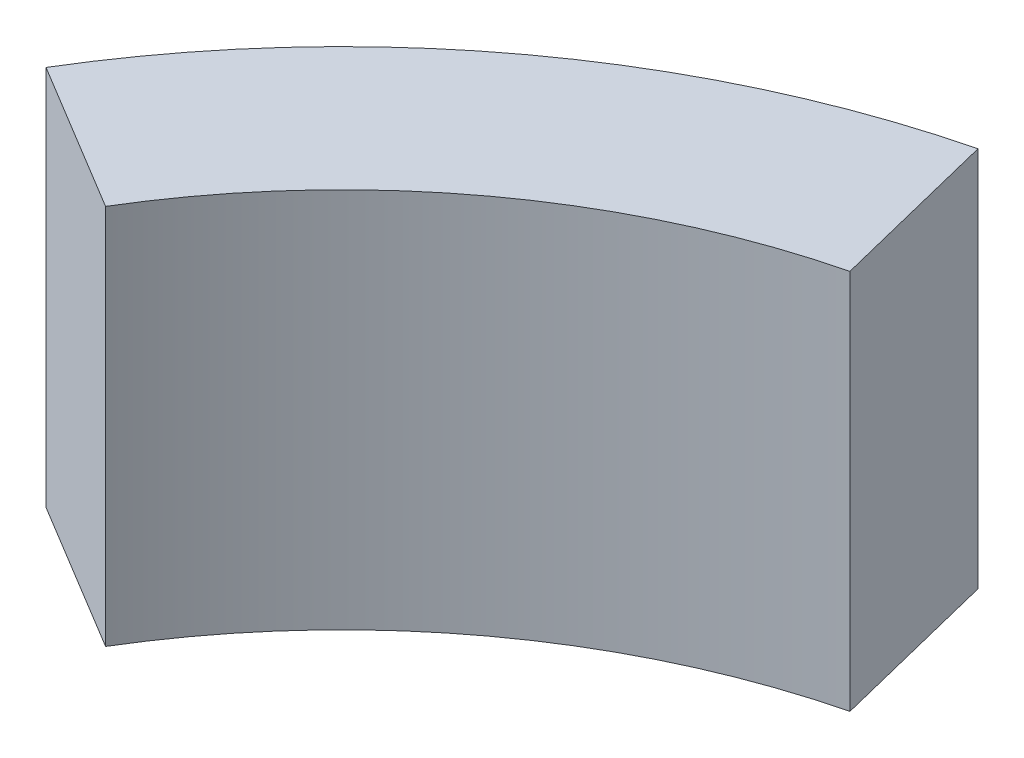
ISO-10303-21;
HEADER;
FILE_DESCRIPTION(('STEP AP214'),'2;1');
FILE_NAME('part.step','',(''),(''),'','','');
FILE_SCHEMA(('AUTOMOTIVE_DESIGN { 1 0 10303 214 1 1 1 1 }'));
ENDSEC;
DATA;
#1=APPLICATION_CONTEXT('core data for automotive mechanical design processes');
#2=APPLICATION_PROTOCOL_DEFINITION('international standard','automotive_design',2000,#1);
#3=PRODUCT_CONTEXT('',#1,'mechanical');
#4=PRODUCT('Part','Part','',(#3));
#5=PRODUCT_RELATED_PRODUCT_CATEGORY('part','',(#4));
#6=PRODUCT_DEFINITION_FORMATION('','',#4);
#7=PRODUCT_DEFINITION_CONTEXT('part definition',#1,'design');
#8=PRODUCT_DEFINITION('design','',#6,#7);
#9=PRODUCT_DEFINITION_SHAPE('','',#8);
#10=(LENGTH_UNIT() NAMED_UNIT(*) SI_UNIT(.MILLI.,.METRE.));
#11=(NAMED_UNIT(*) PLANE_ANGLE_UNIT() SI_UNIT($,.RADIAN.));
#12=(NAMED_UNIT(*) SI_UNIT($,.STERADIAN.) SOLID_ANGLE_UNIT());
#13=UNCERTAINTY_MEASURE_WITH_UNIT(LENGTH_MEASURE(1.E-05),#10,'distance_accuracy_value','');
#14=(GEOMETRIC_REPRESENTATION_CONTEXT(3) GLOBAL_UNCERTAINTY_ASSIGNED_CONTEXT((#13)) GLOBAL_UNIT_ASSIGNED_CONTEXT((#10,
#11,#12)) REPRESENTATION_CONTEXT('',''));
#15=CARTESIAN_POINT('',(0.,0.,0.));
#16=DIRECTION('',(0.,0.,1.));
#17=DIRECTION('',(1.,0.,0.));
#18=AXIS2_PLACEMENT_3D('',#15,#16,#17);
#19=CARTESIAN_POINT('',(0.,12.,0.));
#20=DIRECTION('',(0.,-1.,0.));
#21=DIRECTION('',(0.,0.,-1.));
#22=AXIS2_PLACEMENT_3D('',#19,#20,#21);
#23=CYLINDRICAL_SURFACE('',#22,27.42);
#24=CARTESIAN_POINT('',(0.,0.,0.));
#25=DIRECTION('',(0.,1.,0.));
#26=DIRECTION('',(0.,0.,-1.));
#27=AXIS2_PLACEMENT_3D('',#24,#25,#26);
#28=CIRCLE('',#27,27.42);
#29=CARTESIAN_POINT('',(-6.58973102171448,0.,-26.6163830198893));
#30=VERTEX_POINT('',#29);
#31=CARTESIAN_POINT('',(-23.4802684156719,0.,-14.1609814323725));
#32=VERTEX_POINT('',#31);
#33=EDGE_CURVE('E96',#30,#32,#28,.T.);
#34=ORIENTED_EDGE('',*,*,#33,.T.);
#35=DIRECTION('',(0.,-1.,0.));
#36=VECTOR('',#35,1.);
#37=CARTESIAN_POINT('',(-23.4802684156719,12.,-14.1609814323725));
#38=LINE('',#37,#36);
#39=CARTESIAN_POINT('',(-23.4802684156719,12.,-14.1609814323725));
#40=VERTEX_POINT('',#39);
#41=EDGE_CURVE('E11',#40,#32,#38,.T.);
#42=ORIENTED_EDGE('',*,*,#41,.F.);
#43=CARTESIAN_POINT('',(0.,12.,0.));
#44=DIRECTION('',(0.,1.,0.));
#45=DIRECTION('',(0.,0.,-1.));
#46=AXIS2_PLACEMENT_3D('',#43,#44,#45);
#47=CIRCLE('',#46,27.42);
#48=CARTESIAN_POINT('',(-6.58973102171448,12.,-26.6163830198893));
#49=VERTEX_POINT('',#48);
#50=EDGE_CURVE('E84',#49,#40,#47,.T.);
#51=ORIENTED_EDGE('',*,*,#50,.F.);
#52=DIRECTION('',(0.,-1.,0.));
#53=VECTOR('',#52,1.);
#54=CARTESIAN_POINT('',(-6.58973102171448,12.,-26.6163830198893));
#55=LINE('',#54,#53);
#56=EDGE_CURVE('E92',#49,#30,#55,.T.);
#57=ORIENTED_EDGE('',*,*,#56,.T.);
#58=EDGE_LOOP('',(#34,#42,#51,#57));
#59=FACE_BOUND('',#58,.T.);
#60=ADVANCED_FACE('F33',(#59),#23,.T.);
#61=CARTESIAN_POINT('',(-23.4802684156719,12.,-14.1609814323725));
#62=DIRECTION('',(0.51644717112956,0.,-0.856319052358568));
#63=DIRECTION('',(-0.856319052358568,0.,-0.51644717112956));
#64=AXIS2_PLACEMENT_3D('',#61,#62,#63);
#65=PLANE('',#64);
#66=DIRECTION('',(0.856319052358568,0.,0.51644717112956));
#67=VECTOR('',#66,1.);
#68=CARTESIAN_POINT('',(-23.4802684156719,0.,-14.1609814323725));
#69=LINE('',#68,#67);
#70=CARTESIAN_POINT('',(-18.7533872466526,0.,-11.3101930477374));
#71=VERTEX_POINT('',#70);
#72=EDGE_CURVE('E88',#32,#71,#69,.T.);
#73=ORIENTED_EDGE('',*,*,#72,.T.);
#74=DIRECTION('',(0.,-1.,0.));
#75=VECTOR('',#74,1.);
#76=CARTESIAN_POINT('',(-18.7533872466526,12.,-11.3101930477374));
#77=LINE('',#76,#75);
#78=CARTESIAN_POINT('',(-18.7533872466526,12.,-11.3101930477374));
#79=VERTEX_POINT('',#78);
#80=EDGE_CURVE('E41',#79,#71,#77,.T.);
#81=ORIENTED_EDGE('',*,*,#80,.F.);
#82=DIRECTION('',(0.856319052358568,0.,0.51644717112956));
#83=VECTOR('',#82,1.);
#84=CARTESIAN_POINT('',(-23.4802684156719,12.,-14.1609814323725));
#85=LINE('',#84,#83);
#86=EDGE_CURVE('E79',#40,#79,#85,.T.);
#87=ORIENTED_EDGE('',*,*,#86,.F.);
#88=ORIENTED_EDGE('',*,*,#41,.T.);
#89=EDGE_LOOP('',(#73,#81,#87,#88));
#90=FACE_BOUND('',#89,.T.);
#91=ADVANCED_FACE('F87',(#90),#65,.F.);
#92=CARTESIAN_POINT('',(0.,12.,0.));
#93=DIRECTION('',(0.,-1.,0.));
#94=DIRECTION('',(0.,0.,-1.));
#95=AXIS2_PLACEMENT_3D('',#92,#93,#94);
#96=CYLINDRICAL_SURFACE('',#95,21.9);
#97=CARTESIAN_POINT('',(0.,0.,0.));
#98=DIRECTION('',(0.,-1.,0.));
#99=DIRECTION('',(0.,0.,-1.));
#100=AXIS2_PLACEMENT_3D('',#97,#98,#99);
#101=CIRCLE('',#100,21.9);
#102=CARTESIAN_POINT('',(-5.26313309174132,0.,-21.2581614929094));
#103=VERTEX_POINT('',#102);
#104=EDGE_CURVE('E66',#71,#103,#101,.T.);
#105=ORIENTED_EDGE('',*,*,#104,.T.);
#106=DIRECTION('',(0.,-1.,0.));
#107=VECTOR('',#106,1.);
#108=CARTESIAN_POINT('',(-5.26313309174132,12.,-21.2581614929094));
#109=LINE('',#108,#107);
#110=CARTESIAN_POINT('',(-5.26313309174132,12.,-21.2581614929094));
#111=VERTEX_POINT('',#110);
#112=EDGE_CURVE('E89',#111,#103,#109,.T.);
#113=ORIENTED_EDGE('',*,*,#112,.F.);
#114=CARTESIAN_POINT('',(0.,12.,0.));
#115=DIRECTION('',(0.,-1.,0.));
#116=DIRECTION('',(0.,0.,-1.));
#117=AXIS2_PLACEMENT_3D('',#114,#115,#116);
#118=CIRCLE('',#117,21.9);
#119=EDGE_CURVE('E82',#79,#111,#118,.T.);
#120=ORIENTED_EDGE('',*,*,#119,.F.);
#121=ORIENTED_EDGE('',*,*,#80,.T.);
#122=EDGE_LOOP('',(#105,#113,#120,#121));
#123=FACE_BOUND('',#122,.T.);
#124=ADVANCED_FACE('F90',(#123),#96,.F.);
#125=CARTESIAN_POINT('',(-6.58973102171448,12.,-26.6163830198893));
#126=DIRECTION('',(-0.970692305612303,0.,0.240325711951659));
#127=DIRECTION('',(0.240325711951659,0.,0.970692305612303));
#128=AXIS2_PLACEMENT_3D('',#125,#126,#127);
#129=PLANE('',#128);
#130=DIRECTION('',(-0.240325711951659,0.,-0.970692305612303));
#131=VECTOR('',#130,1.);
#132=CARTESIAN_POINT('',(-6.58973102171448,0.,-26.6163830198893));
#133=LINE('',#132,#131);
#134=EDGE_CURVE('E72',#103,#30,#133,.T.);
#135=ORIENTED_EDGE('',*,*,#134,.T.);
#136=ORIENTED_EDGE('',*,*,#56,.F.);
#137=DIRECTION('',(-0.240325711951659,0.,-0.970692305612303));
#138=VECTOR('',#137,1.);
#139=CARTESIAN_POINT('',(-6.58973102171448,12.,-26.6163830198893));
#140=LINE('',#139,#138);
#141=EDGE_CURVE('E49',#111,#49,#140,.T.);
#142=ORIENTED_EDGE('',*,*,#141,.F.);
#143=ORIENTED_EDGE('',*,*,#112,.T.);
#144=EDGE_LOOP('',(#135,#136,#142,#143));
#145=FACE_BOUND('',#144,.T.);
#146=ADVANCED_FACE('F103',(#145),#129,.F.);
#147=CARTESIAN_POINT('',(0.,12.,0.));
#148=DIRECTION('',(0.,-1.,0.));
#149=DIRECTION('',(0.,0.,-1.));
#150=AXIS2_PLACEMENT_3D('',#147,#148,#149);
#151=PLANE('',#150);
#152=ORIENTED_EDGE('',*,*,#50,.T.);
#153=ORIENTED_EDGE('',*,*,#86,.T.);
#154=ORIENTED_EDGE('',*,*,#119,.T.);
#155=ORIENTED_EDGE('',*,*,#141,.T.);
#156=EDGE_LOOP('',(#152,#153,#154,#155));
#157=FACE_BOUND('',#156,.T.);
#158=ADVANCED_FACE('F80',(#157),#151,.F.);
#159=CARTESIAN_POINT('',(0.,0.,0.));
#160=DIRECTION('',(0.,-1.,0.));
#161=DIRECTION('',(0.,0.,-1.));
#162=AXIS2_PLACEMENT_3D('',#159,#160,#161);
#163=PLANE('',#162);
#164=ORIENTED_EDGE('',*,*,#33,.F.);
#165=ORIENTED_EDGE('',*,*,#134,.F.);
#166=ORIENTED_EDGE('',*,*,#104,.F.);
#167=ORIENTED_EDGE('',*,*,#72,.F.);
#168=EDGE_LOOP('',(#164,#165,#166,#167));
#169=FACE_BOUND('',#168,.T.);
#170=ADVANCED_FACE('F106',(#169),#163,.T.);
#171=CLOSED_SHELL('',(#60,#91,#124,#146,#158,#170));
#172=MANIFOLD_SOLID_BREP('B2',#171);
#173=ADVANCED_BREP_SHAPE_REPRESENTATION('',(#18,#172),#14);
#174=SHAPE_DEFINITION_REPRESENTATION(#9,#173);
ENDSEC;
END-ISO-10303-21;
